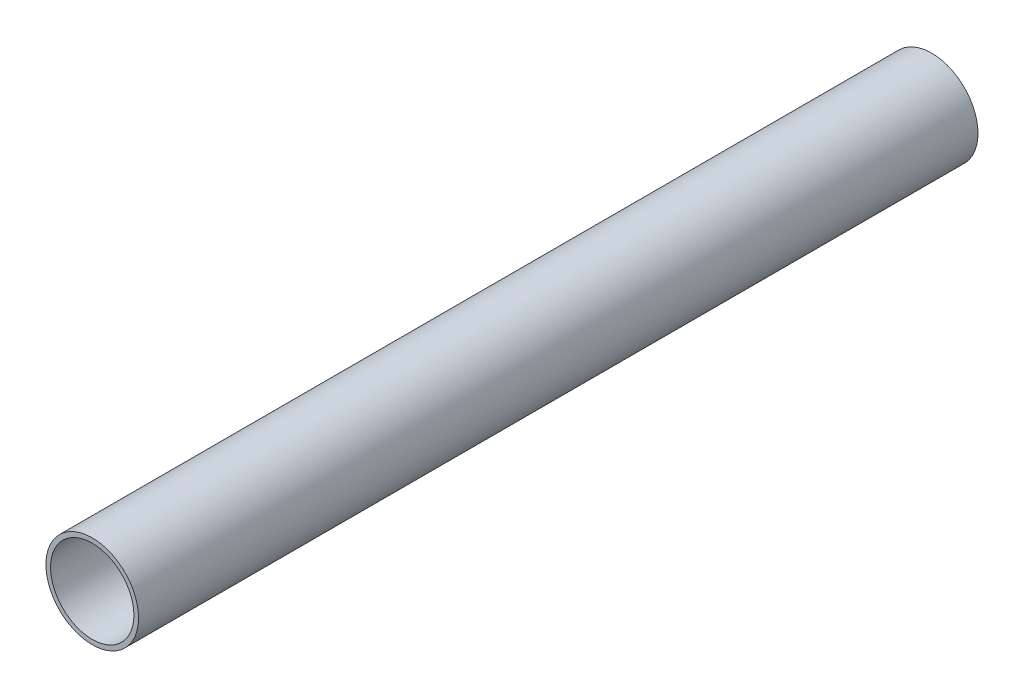
ISO-10303-21;
HEADER;
FILE_DESCRIPTION(('STEP AP214'),'2;1');
FILE_NAME('part.step','',(''),(''),'','','');
FILE_SCHEMA(('AUTOMOTIVE_DESIGN { 1 0 10303 214 1 1 1 1 }'));
ENDSEC;
DATA;
#1=APPLICATION_CONTEXT('core data for automotive mechanical design processes');
#2=APPLICATION_PROTOCOL_DEFINITION('international standard','automotive_design',2000,#1);
#3=PRODUCT_CONTEXT('',#1,'mechanical');
#4=PRODUCT('Part','Part','',(#3));
#5=PRODUCT_RELATED_PRODUCT_CATEGORY('part','',(#4));
#6=PRODUCT_DEFINITION_FORMATION('','',#4);
#7=PRODUCT_DEFINITION_CONTEXT('part definition',#1,'design');
#8=PRODUCT_DEFINITION('design','',#6,#7);
#9=PRODUCT_DEFINITION_SHAPE('','',#8);
#10=(LENGTH_UNIT() NAMED_UNIT(*) SI_UNIT(.MILLI.,.METRE.));
#11=(NAMED_UNIT(*) PLANE_ANGLE_UNIT() SI_UNIT($,.RADIAN.));
#12=(NAMED_UNIT(*) SI_UNIT($,.STERADIAN.) SOLID_ANGLE_UNIT());
#13=UNCERTAINTY_MEASURE_WITH_UNIT(LENGTH_MEASURE(1.E-05),#10,'distance_accuracy_value','');
#14=(GEOMETRIC_REPRESENTATION_CONTEXT(3) GLOBAL_UNCERTAINTY_ASSIGNED_CONTEXT((#13)) GLOBAL_UNIT_ASSIGNED_CONTEXT((#10,
#11,#12)) REPRESENTATION_CONTEXT('',''));
#15=CARTESIAN_POINT('',(0.,0.,0.));
#16=DIRECTION('',(0.,0.,1.));
#17=DIRECTION('',(1.,0.,0.));
#18=AXIS2_PLACEMENT_3D('',#15,#16,#17);
#19=CARTESIAN_POINT('',(0.,0.,72.5));
#20=DIRECTION('',(0.,0.,1.));
#21=DIRECTION('',(1.,0.,0.));
#22=AXIS2_PLACEMENT_3D('',#19,#20,#21);
#23=PLANE('',#22);
#24=CARTESIAN_POINT('',(0.,0.,72.5));
#25=DIRECTION('',(0.,0.,1.));
#26=DIRECTION('',(1.,0.,0.));
#27=AXIS2_PLACEMENT_3D('',#24,#25,#26);
#28=CIRCLE('',#27,8.);
#29=CARTESIAN_POINT('',(8.,0.,72.5));
#30=VERTEX_POINT('',#29);
#31=EDGE_CURVE('E9',#30,#30,#28,.T.);
#32=ORIENTED_EDGE('',*,*,#31,.T.);
#33=EDGE_LOOP('',(#32));
#34=FACE_BOUND('',#33,.T.);
#35=CARTESIAN_POINT('',(0.,0.,72.5));
#36=DIRECTION('',(0.,0.,1.));
#37=DIRECTION('',(1.,0.,0.));
#38=AXIS2_PLACEMENT_3D('',#35,#36,#37);
#39=CIRCLE('',#38,7.2);
#40=CARTESIAN_POINT('',(7.2,0.,72.5));
#41=VERTEX_POINT('',#40);
#42=EDGE_CURVE('E34',#41,#41,#39,.T.);
#43=ORIENTED_EDGE('',*,*,#42,.F.);
#44=EDGE_LOOP('',(#43));
#45=FACE_BOUND('',#44,.T.);
#46=ADVANCED_FACE('F14',(#34,#45),#23,.T.);
#47=CARTESIAN_POINT('',(0.,0.,-72.5));
#48=DIRECTION('',(0.,0.,1.));
#49=DIRECTION('',(1.,0.,0.));
#50=AXIS2_PLACEMENT_3D('',#47,#48,#49);
#51=PLANE('',#50);
#52=CARTESIAN_POINT('',(0.,0.,-72.5));
#53=DIRECTION('',(0.,0.,1.));
#54=DIRECTION('',(1.,0.,0.));
#55=AXIS2_PLACEMENT_3D('',#52,#53,#54);
#56=CIRCLE('',#55,8.);
#57=CARTESIAN_POINT('',(8.,0.,-72.5));
#58=VERTEX_POINT('',#57);
#59=EDGE_CURVE('E18',#58,#58,#56,.T.);
#60=ORIENTED_EDGE('',*,*,#59,.F.);
#61=EDGE_LOOP('',(#60));
#62=FACE_BOUND('',#61,.T.);
#63=CARTESIAN_POINT('',(0.,0.,-72.5));
#64=DIRECTION('',(0.,0.,1.));
#65=DIRECTION('',(1.,0.,0.));
#66=AXIS2_PLACEMENT_3D('',#63,#64,#65);
#67=CIRCLE('',#66,7.2);
#68=CARTESIAN_POINT('',(7.2,0.,-72.5));
#69=VERTEX_POINT('',#68);
#70=EDGE_CURVE('E29',#69,#69,#67,.T.);
#71=ORIENTED_EDGE('',*,*,#70,.T.);
#72=EDGE_LOOP('',(#71));
#73=FACE_BOUND('',#72,.T.);
#74=ADVANCED_FACE('F47',(#62,#73),#51,.F.);
#75=CARTESIAN_POINT('',(0.,0.,72.5));
#76=DIRECTION('',(0.,0.,-1.));
#77=DIRECTION('',(-1.,0.,0.));
#78=AXIS2_PLACEMENT_3D('',#75,#76,#77);
#79=CYLINDRICAL_SURFACE('',#78,8.);
#80=ORIENTED_EDGE('',*,*,#31,.F.);
#81=EDGE_LOOP('',(#80));
#82=FACE_BOUND('',#81,.T.);
#83=ORIENTED_EDGE('',*,*,#59,.T.);
#84=EDGE_LOOP('',(#83));
#85=FACE_BOUND('',#84,.T.);
#86=ADVANCED_FACE('F16',(#82,#85),#79,.T.);
#87=CARTESIAN_POINT('',(0.,0.,72.5));
#88=DIRECTION('',(0.,0.,-1.));
#89=DIRECTION('',(-1.,0.,0.));
#90=AXIS2_PLACEMENT_3D('',#87,#88,#89);
#91=CYLINDRICAL_SURFACE('',#90,7.2);
#92=ORIENTED_EDGE('',*,*,#42,.T.);
#93=EDGE_LOOP('',(#92));
#94=FACE_BOUND('',#93,.T.);
#95=ORIENTED_EDGE('',*,*,#70,.F.);
#96=EDGE_LOOP('',(#95));
#97=FACE_BOUND('',#96,.T.);
#98=ADVANCED_FACE('F43',(#94,#97),#91,.F.);
#99=CLOSED_SHELL('',(#46,#74,#86,#98));
#100=MANIFOLD_SOLID_BREP('B1',#99);
#101=ADVANCED_BREP_SHAPE_REPRESENTATION('',(#18,#100),#14);
#102=SHAPE_DEFINITION_REPRESENTATION(#9,#101);
ENDSEC;
END-ISO-10303-21;
